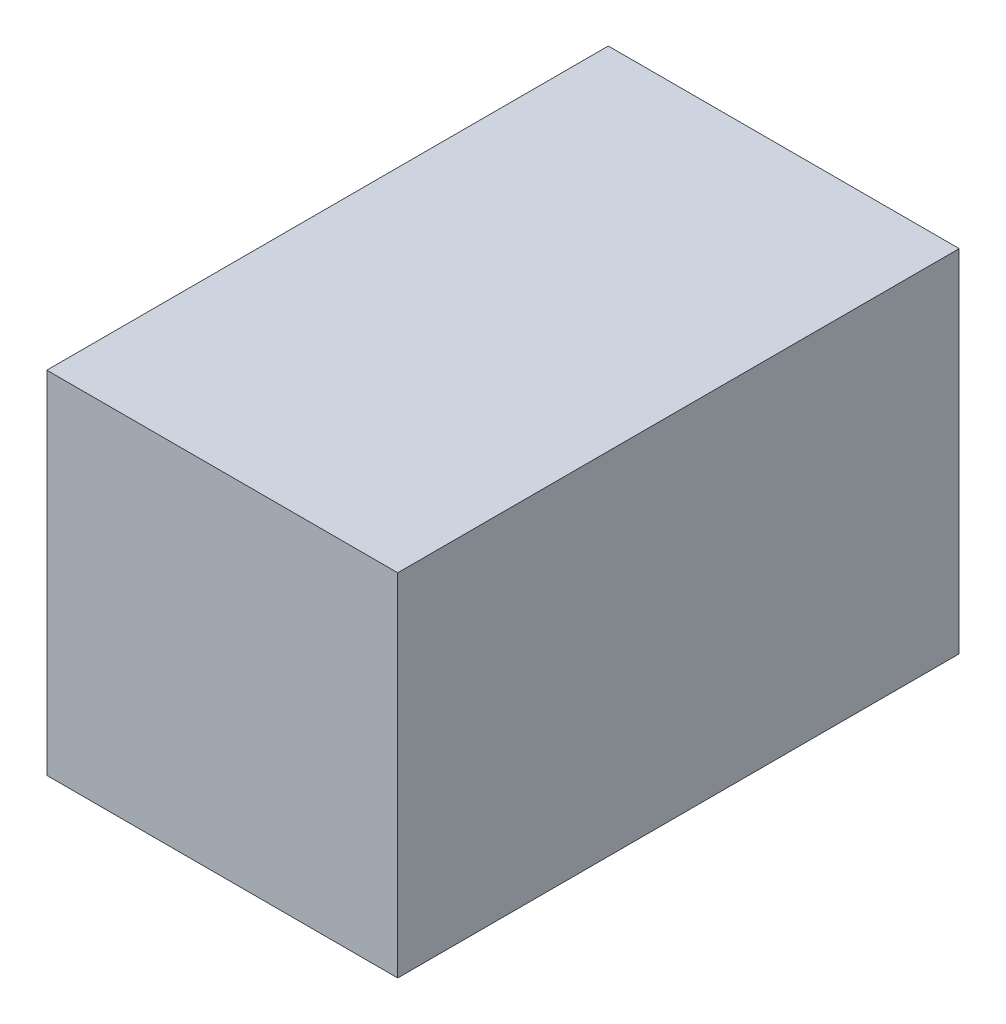
ISO-10303-21;
HEADER;
FILE_DESCRIPTION(('STEP AP214'),'2;1');
FILE_NAME('part.step','',(''),(''),'','','');
FILE_SCHEMA(('AUTOMOTIVE_DESIGN { 1 0 10303 214 1 1 1 1 }'));
ENDSEC;
DATA;
#1=APPLICATION_CONTEXT('core data for automotive mechanical design processes');
#2=APPLICATION_PROTOCOL_DEFINITION('international standard','automotive_design',2000,#1);
#3=PRODUCT_CONTEXT('',#1,'mechanical');
#4=PRODUCT('Part','Part','',(#3));
#5=PRODUCT_RELATED_PRODUCT_CATEGORY('part','',(#4));
#6=PRODUCT_DEFINITION_FORMATION('','',#4);
#7=PRODUCT_DEFINITION_CONTEXT('part definition',#1,'design');
#8=PRODUCT_DEFINITION('design','',#6,#7);
#9=PRODUCT_DEFINITION_SHAPE('','',#8);
#10=(LENGTH_UNIT() NAMED_UNIT(*) SI_UNIT(.MILLI.,.METRE.));
#11=(NAMED_UNIT(*) PLANE_ANGLE_UNIT() SI_UNIT($,.RADIAN.));
#12=(NAMED_UNIT(*) SI_UNIT($,.STERADIAN.) SOLID_ANGLE_UNIT());
#13=UNCERTAINTY_MEASURE_WITH_UNIT(LENGTH_MEASURE(1.E-05),#10,'distance_accuracy_value','');
#14=(GEOMETRIC_REPRESENTATION_CONTEXT(3) GLOBAL_UNCERTAINTY_ASSIGNED_CONTEXT((#13)) GLOBAL_UNIT_ASSIGNED_CONTEXT((#10,
#11,#12)) REPRESENTATION_CONTEXT('',''));
#15=CARTESIAN_POINT('',(0.,0.,0.));
#16=DIRECTION('',(0.,0.,1.));
#17=DIRECTION('',(1.,0.,0.));
#18=AXIS2_PLACEMENT_3D('',#15,#16,#17);
#19=CARTESIAN_POINT('',(0.5,1.,-0.8));
#20=DIRECTION('',(-1.,0.,0.));
#21=DIRECTION('',(0.,0.,1.));
#22=AXIS2_PLACEMENT_3D('',#19,#20,#21);
#23=PLANE('',#22);
#24=DIRECTION('',(0.,0.,-1.));
#25=VECTOR('',#24,1.);
#26=CARTESIAN_POINT('',(0.5,0.,-0.8));
#27=LINE('',#26,#25);
#28=CARTESIAN_POINT('',(0.5,0.,0.8));
#29=VERTEX_POINT('',#28);
#30=CARTESIAN_POINT('',(0.5,0.,-0.8));
#31=VERTEX_POINT('',#30);
#32=EDGE_CURVE('E97',#29,#31,#27,.T.);
#33=ORIENTED_EDGE('',*,*,#32,.T.);
#34=DIRECTION('',(0.,-1.,0.));
#35=VECTOR('',#34,1.);
#36=CARTESIAN_POINT('',(0.5,1.,-0.8));
#37=LINE('',#36,#35);
#38=CARTESIAN_POINT('',(0.5,1.,-0.8));
#39=VERTEX_POINT('',#38);
#40=EDGE_CURVE('E11',#39,#31,#37,.T.);
#41=ORIENTED_EDGE('',*,*,#40,.F.);
#42=DIRECTION('',(0.,0.,-1.));
#43=VECTOR('',#42,1.);
#44=CARTESIAN_POINT('',(0.5,1.,-0.8));
#45=LINE('',#44,#43);
#46=CARTESIAN_POINT('',(0.5,1.,0.8));
#47=VERTEX_POINT('',#46);
#48=EDGE_CURVE('E85',#47,#39,#45,.T.);
#49=ORIENTED_EDGE('',*,*,#48,.F.);
#50=DIRECTION('',(0.,-1.,0.));
#51=VECTOR('',#50,1.);
#52=CARTESIAN_POINT('',(0.5,1.,0.8));
#53=LINE('',#52,#51);
#54=EDGE_CURVE('E93',#47,#29,#53,.T.);
#55=ORIENTED_EDGE('',*,*,#54,.T.);
#56=EDGE_LOOP('',(#33,#41,#49,#55));
#57=FACE_BOUND('',#56,.T.);
#58=ADVANCED_FACE('F34',(#57),#23,.F.);
#59=CARTESIAN_POINT('',(-0.5,1.,-0.8));
#60=DIRECTION('',(0.,0.,1.));
#61=DIRECTION('',(1.,0.,0.));
#62=AXIS2_PLACEMENT_3D('',#59,#60,#61);
#63=PLANE('',#62);
#64=DIRECTION('',(-1.,0.,0.));
#65=VECTOR('',#64,1.);
#66=CARTESIAN_POINT('',(-0.5,0.,-0.8));
#67=LINE('',#66,#65);
#68=CARTESIAN_POINT('',(-0.5,0.,-0.8));
#69=VERTEX_POINT('',#68);
#70=EDGE_CURVE('E89',#31,#69,#67,.T.);
#71=ORIENTED_EDGE('',*,*,#70,.T.);
#72=DIRECTION('',(0.,-1.,0.));
#73=VECTOR('',#72,1.);
#74=CARTESIAN_POINT('',(-0.5,1.,-0.8));
#75=LINE('',#74,#73);
#76=CARTESIAN_POINT('',(-0.5,1.,-0.8));
#77=VERTEX_POINT('',#76);
#78=EDGE_CURVE('E42',#77,#69,#75,.T.);
#79=ORIENTED_EDGE('',*,*,#78,.F.);
#80=DIRECTION('',(-1.,0.,0.));
#81=VECTOR('',#80,1.);
#82=CARTESIAN_POINT('',(-0.5,1.,-0.8));
#83=LINE('',#82,#81);
#84=EDGE_CURVE('E80',#39,#77,#83,.T.);
#85=ORIENTED_EDGE('',*,*,#84,.F.);
#86=ORIENTED_EDGE('',*,*,#40,.T.);
#87=EDGE_LOOP('',(#71,#79,#85,#86));
#88=FACE_BOUND('',#87,.T.);
#89=ADVANCED_FACE('F88',(#88),#63,.F.);
#90=CARTESIAN_POINT('',(-0.5,1.,-0.8));
#91=DIRECTION('',(1.,0.,0.));
#92=DIRECTION('',(0.,0.,-1.));
#93=AXIS2_PLACEMENT_3D('',#90,#91,#92);
#94=PLANE('',#93);
#95=DIRECTION('',(0.,0.,1.));
#96=VECTOR('',#95,1.);
#97=CARTESIAN_POINT('',(-0.5,0.,-0.8));
#98=LINE('',#97,#96);
#99=CARTESIAN_POINT('',(-0.5,0.,0.8));
#100=VERTEX_POINT('',#99);
#101=EDGE_CURVE('E67',#69,#100,#98,.T.);
#102=ORIENTED_EDGE('',*,*,#101,.T.);
#103=DIRECTION('',(0.,-1.,0.));
#104=VECTOR('',#103,1.);
#105=CARTESIAN_POINT('',(-0.5,1.,0.8));
#106=LINE('',#105,#104);
#107=CARTESIAN_POINT('',(-0.5,1.,0.8));
#108=VERTEX_POINT('',#107);
#109=EDGE_CURVE('E90',#108,#100,#106,.T.);
#110=ORIENTED_EDGE('',*,*,#109,.F.);
#111=DIRECTION('',(0.,0.,1.));
#112=VECTOR('',#111,1.);
#113=CARTESIAN_POINT('',(-0.5,1.,-0.8));
#114=LINE('',#113,#112);
#115=EDGE_CURVE('E83',#77,#108,#114,.T.);
#116=ORIENTED_EDGE('',*,*,#115,.F.);
#117=ORIENTED_EDGE('',*,*,#78,.T.);
#118=EDGE_LOOP('',(#102,#110,#116,#117));
#119=FACE_BOUND('',#118,.T.);
#120=ADVANCED_FACE('F91',(#119),#94,.F.);
#121=CARTESIAN_POINT('',(-0.5,1.,0.8));
#122=DIRECTION('',(0.,0.,-1.));
#123=DIRECTION('',(-1.,0.,0.));
#124=AXIS2_PLACEMENT_3D('',#121,#122,#123);
#125=PLANE('',#124);
#126=DIRECTION('',(1.,0.,0.));
#127=VECTOR('',#126,1.);
#128=CARTESIAN_POINT('',(-0.5,0.,0.8));
#129=LINE('',#128,#127);
#130=EDGE_CURVE('E73',#100,#29,#129,.T.);
#131=ORIENTED_EDGE('',*,*,#130,.T.);
#132=ORIENTED_EDGE('',*,*,#54,.F.);
#133=DIRECTION('',(1.,0.,0.));
#134=VECTOR('',#133,1.);
#135=CARTESIAN_POINT('',(-0.5,1.,0.8));
#136=LINE('',#135,#134);
#137=EDGE_CURVE('E50',#108,#47,#136,.T.);
#138=ORIENTED_EDGE('',*,*,#137,.F.);
#139=ORIENTED_EDGE('',*,*,#109,.T.);
#140=EDGE_LOOP('',(#131,#132,#138,#139));
#141=FACE_BOUND('',#140,.T.);
#142=ADVANCED_FACE('F104',(#141),#125,.F.);
#143=CARTESIAN_POINT('',(0.,1.,0.));
#144=DIRECTION('',(0.,1.,0.));
#145=DIRECTION('',(0.,0.,1.));
#146=AXIS2_PLACEMENT_3D('',#143,#144,#145);
#147=PLANE('',#146);
#148=ORIENTED_EDGE('',*,*,#48,.T.);
#149=ORIENTED_EDGE('',*,*,#84,.T.);
#150=ORIENTED_EDGE('',*,*,#115,.T.);
#151=ORIENTED_EDGE('',*,*,#137,.T.);
#152=EDGE_LOOP('',(#148,#149,#150,#151));
#153=FACE_BOUND('',#152,.T.);
#154=ADVANCED_FACE('F81',(#153),#147,.T.);
#155=CARTESIAN_POINT('',(0.,0.,0.));
#156=DIRECTION('',(0.,1.,0.));
#157=DIRECTION('',(0.,0.,1.));
#158=AXIS2_PLACEMENT_3D('',#155,#156,#157);
#159=PLANE('',#158);
#160=ORIENTED_EDGE('',*,*,#32,.F.);
#161=ORIENTED_EDGE('',*,*,#130,.F.);
#162=ORIENTED_EDGE('',*,*,#101,.F.);
#163=ORIENTED_EDGE('',*,*,#70,.F.);
#164=EDGE_LOOP('',(#160,#161,#162,#163));
#165=FACE_BOUND('',#164,.T.);
#166=ADVANCED_FACE('F107',(#165),#159,.F.);
#167=CLOSED_SHELL('',(#58,#89,#120,#142,#154,#166));
#168=MANIFOLD_SOLID_BREP('B2',#167);
#169=ADVANCED_BREP_SHAPE_REPRESENTATION('',(#18,#168),#14);
#170=SHAPE_DEFINITION_REPRESENTATION(#9,#169);
ENDSEC;
END-ISO-10303-21;
